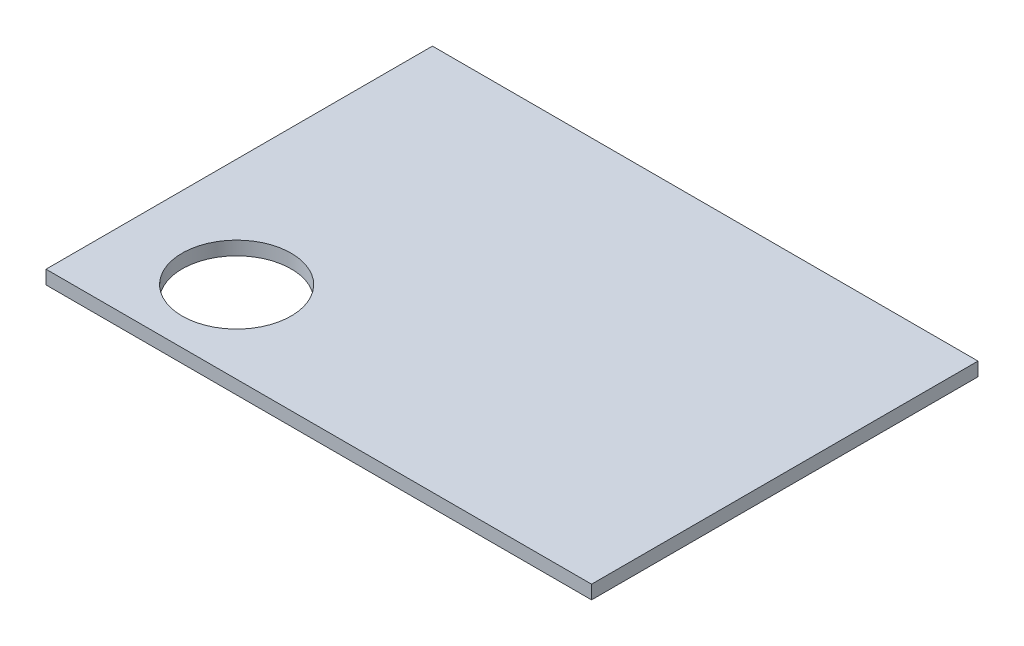
ISO-10303-21;
HEADER;
FILE_DESCRIPTION(('STEP AP214'),'2;1');
FILE_NAME('part.step','',(''),(''),'','','');
FILE_SCHEMA(('AUTOMOTIVE_DESIGN { 1 0 10303 214 1 1 1 1 }'));
ENDSEC;
DATA;
#1=APPLICATION_CONTEXT('core data for automotive mechanical design processes');
#2=APPLICATION_PROTOCOL_DEFINITION('international standard','automotive_design',2000,#1);
#3=PRODUCT_CONTEXT('',#1,'mechanical');
#4=PRODUCT('Part','Part','',(#3));
#5=PRODUCT_RELATED_PRODUCT_CATEGORY('part','',(#4));
#6=PRODUCT_DEFINITION_FORMATION('','',#4);
#7=PRODUCT_DEFINITION_CONTEXT('part definition',#1,'design');
#8=PRODUCT_DEFINITION('design','',#6,#7);
#9=PRODUCT_DEFINITION_SHAPE('','',#8);
#10=(LENGTH_UNIT() NAMED_UNIT(*) SI_UNIT(.MILLI.,.METRE.));
#11=(NAMED_UNIT(*) PLANE_ANGLE_UNIT() SI_UNIT($,.RADIAN.));
#12=(NAMED_UNIT(*) SI_UNIT($,.STERADIAN.) SOLID_ANGLE_UNIT());
#13=UNCERTAINTY_MEASURE_WITH_UNIT(LENGTH_MEASURE(1.E-05),#10,'distance_accuracy_value','');
#14=(GEOMETRIC_REPRESENTATION_CONTEXT(3) GLOBAL_UNCERTAINTY_ASSIGNED_CONTEXT((#13)) GLOBAL_UNIT_ASSIGNED_CONTEXT((#10,
#11,#12)) REPRESENTATION_CONTEXT('',''));
#15=CARTESIAN_POINT('',(0.,0.,0.));
#16=DIRECTION('',(0.,0.,1.));
#17=DIRECTION('',(1.,0.,0.));
#18=AXIS2_PLACEMENT_3D('',#15,#16,#17);
#19=CARTESIAN_POINT('',(-60.,3.,42.5));
#20=DIRECTION('',(1.,0.,0.));
#21=DIRECTION('',(0.,0.,-1.));
#22=AXIS2_PLACEMENT_3D('',#19,#20,#21);
#23=PLANE('',#22);
#24=DIRECTION('',(0.,0.,1.));
#25=VECTOR('',#24,1.);
#26=CARTESIAN_POINT('',(-60.,0.,42.5));
#27=LINE('',#26,#25);
#28=CARTESIAN_POINT('',(-60.,0.,-42.5));
#29=VERTEX_POINT('',#28);
#30=CARTESIAN_POINT('',(-60.,0.,42.5));
#31=VERTEX_POINT('',#30);
#32=EDGE_CURVE('E106',#29,#31,#27,.T.);
#33=ORIENTED_EDGE('',*,*,#32,.T.);
#34=DIRECTION('',(0.,-1.,0.));
#35=VECTOR('',#34,1.);
#36=CARTESIAN_POINT('',(-60.,3.,42.5));
#37=LINE('',#36,#35);
#38=CARTESIAN_POINT('',(-60.,3.,42.5));
#39=VERTEX_POINT('',#38);
#40=EDGE_CURVE('E11',#39,#31,#37,.T.);
#41=ORIENTED_EDGE('',*,*,#40,.F.);
#42=DIRECTION('',(0.,0.,1.));
#43=VECTOR('',#42,1.);
#44=CARTESIAN_POINT('',(-60.,3.,42.5));
#45=LINE('',#44,#43);
#46=CARTESIAN_POINT('',(-60.,3.,-42.5));
#47=VERTEX_POINT('',#46);
#48=EDGE_CURVE('E90',#47,#39,#45,.T.);
#49=ORIENTED_EDGE('',*,*,#48,.F.);
#50=DIRECTION('',(0.,-1.,0.));
#51=VECTOR('',#50,1.);
#52=CARTESIAN_POINT('',(-60.,3.,-42.5));
#53=LINE('',#52,#51);
#54=EDGE_CURVE('E102',#47,#29,#53,.T.);
#55=ORIENTED_EDGE('',*,*,#54,.T.);
#56=EDGE_LOOP('',(#33,#41,#49,#55));
#57=FACE_BOUND('',#56,.T.);
#58=ADVANCED_FACE('F38',(#57),#23,.F.);
#59=CARTESIAN_POINT('',(60.,3.,42.5));
#60=DIRECTION('',(0.,0.,-1.));
#61=DIRECTION('',(-1.,0.,0.));
#62=AXIS2_PLACEMENT_3D('',#59,#60,#61);
#63=PLANE('',#62);
#64=DIRECTION('',(1.,0.,0.));
#65=VECTOR('',#64,1.);
#66=CARTESIAN_POINT('',(60.,0.,42.5));
#67=LINE('',#66,#65);
#68=CARTESIAN_POINT('',(60.,0.,42.5));
#69=VERTEX_POINT('',#68);
#70=EDGE_CURVE('E95',#31,#69,#67,.T.);
#71=ORIENTED_EDGE('',*,*,#70,.T.);
#72=DIRECTION('',(0.,-1.,0.));
#73=VECTOR('',#72,1.);
#74=CARTESIAN_POINT('',(60.,3.,42.5));
#75=LINE('',#74,#73);
#76=CARTESIAN_POINT('',(60.,3.,42.5));
#77=VERTEX_POINT('',#76);
#78=EDGE_CURVE('E47',#77,#69,#75,.T.);
#79=ORIENTED_EDGE('',*,*,#78,.F.);
#80=DIRECTION('',(1.,0.,0.));
#81=VECTOR('',#80,1.);
#82=CARTESIAN_POINT('',(60.,3.,42.5));
#83=LINE('',#82,#81);
#84=EDGE_CURVE('E85',#39,#77,#83,.T.);
#85=ORIENTED_EDGE('',*,*,#84,.F.);
#86=ORIENTED_EDGE('',*,*,#40,.T.);
#87=EDGE_LOOP('',(#71,#79,#85,#86));
#88=FACE_BOUND('',#87,.T.);
#89=ADVANCED_FACE('F94',(#88),#63,.F.);
#90=CARTESIAN_POINT('',(60.,3.,42.5));
#91=DIRECTION('',(-1.,0.,0.));
#92=DIRECTION('',(0.,0.,1.));
#93=AXIS2_PLACEMENT_3D('',#90,#91,#92);
#94=PLANE('',#93);
#95=DIRECTION('',(0.,0.,-1.));
#96=VECTOR('',#95,1.);
#97=CARTESIAN_POINT('',(60.,0.,42.5));
#98=LINE('',#97,#96);
#99=CARTESIAN_POINT('',(60.,0.,-42.5));
#100=VERTEX_POINT('',#99);
#101=EDGE_CURVE('E72',#69,#100,#98,.T.);
#102=ORIENTED_EDGE('',*,*,#101,.T.);
#103=DIRECTION('',(0.,-1.,0.));
#104=VECTOR('',#103,1.);
#105=CARTESIAN_POINT('',(60.,3.,-42.5));
#106=LINE('',#105,#104);
#107=CARTESIAN_POINT('',(60.,3.,-42.5));
#108=VERTEX_POINT('',#107);
#109=EDGE_CURVE('E97',#108,#100,#106,.T.);
#110=ORIENTED_EDGE('',*,*,#109,.F.);
#111=DIRECTION('',(0.,0.,-1.));
#112=VECTOR('',#111,1.);
#113=CARTESIAN_POINT('',(60.,3.,42.5));
#114=LINE('',#113,#112);
#115=EDGE_CURVE('E88',#77,#108,#114,.T.);
#116=ORIENTED_EDGE('',*,*,#115,.F.);
#117=ORIENTED_EDGE('',*,*,#78,.T.);
#118=EDGE_LOOP('',(#102,#110,#116,#117));
#119=FACE_BOUND('',#118,.T.);
#120=ADVANCED_FACE('F98',(#119),#94,.F.);
#121=CARTESIAN_POINT('',(60.,3.,-42.5));
#122=DIRECTION('',(0.,0.,1.));
#123=DIRECTION('',(1.,0.,0.));
#124=AXIS2_PLACEMENT_3D('',#121,#122,#123);
#125=PLANE('',#124);
#126=DIRECTION('',(-1.,0.,0.));
#127=VECTOR('',#126,1.);
#128=CARTESIAN_POINT('',(60.,0.,-42.5));
#129=LINE('',#128,#127);
#130=EDGE_CURVE('E78',#100,#29,#129,.T.);
#131=ORIENTED_EDGE('',*,*,#130,.T.);
#132=ORIENTED_EDGE('',*,*,#54,.F.);
#133=DIRECTION('',(-1.,0.,0.));
#134=VECTOR('',#133,1.);
#135=CARTESIAN_POINT('',(60.,3.,-42.5));
#136=LINE('',#135,#134);
#137=EDGE_CURVE('E55',#108,#47,#136,.T.);
#138=ORIENTED_EDGE('',*,*,#137,.F.);
#139=ORIENTED_EDGE('',*,*,#109,.T.);
#140=EDGE_LOOP('',(#131,#132,#138,#139));
#141=FACE_BOUND('',#140,.T.);
#142=ADVANCED_FACE('F120',(#141),#125,.F.);
#143=CARTESIAN_POINT('',(0.,3.,0.));
#144=DIRECTION('',(0.,1.,0.));
#145=DIRECTION('',(0.,0.,1.));
#146=AXIS2_PLACEMENT_3D('',#143,#144,#145);
#147=PLANE('',#146);
#148=CARTESIAN_POINT('',(-36.1,3.,24.47));
#149=DIRECTION('',(0.,1.,0.));
#150=DIRECTION('',(0.,0.,1.));
#151=AXIS2_PLACEMENT_3D('',#148,#149,#150);
#152=CIRCLE('',#151,11.99);
#153=CARTESIAN_POINT('',(-36.1,3.,36.46));
#154=VERTEX_POINT('',#153);
#155=EDGE_CURVE('E127',#154,#154,#152,.T.);
#156=ORIENTED_EDGE('',*,*,#155,.F.);
#157=EDGE_LOOP('',(#156));
#158=FACE_BOUND('',#157,.T.);
#159=ORIENTED_EDGE('',*,*,#48,.T.);
#160=ORIENTED_EDGE('',*,*,#84,.T.);
#161=ORIENTED_EDGE('',*,*,#115,.T.);
#162=ORIENTED_EDGE('',*,*,#137,.T.);
#163=EDGE_LOOP('',(#159,#160,#161,#162));
#164=FACE_BOUND('',#163,.T.);
#165=ADVANCED_FACE('F86',(#158,#164),#147,.T.);
#166=CARTESIAN_POINT('',(0.,0.,0.));
#167=DIRECTION('',(0.,1.,0.));
#168=DIRECTION('',(0.,0.,1.));
#169=AXIS2_PLACEMENT_3D('',#166,#167,#168);
#170=PLANE('',#169);
#171=CARTESIAN_POINT('',(-36.1,0.,24.47));
#172=DIRECTION('',(0.,1.,0.));
#173=DIRECTION('',(0.,0.,1.));
#174=AXIS2_PLACEMENT_3D('',#171,#172,#173);
#175=CIRCLE('',#174,11.99);
#176=CARTESIAN_POINT('',(-36.1,0.,36.46));
#177=VERTEX_POINT('',#176);
#178=EDGE_CURVE('E110',#177,#177,#175,.T.);
#179=ORIENTED_EDGE('',*,*,#178,.T.);
#180=EDGE_LOOP('',(#179));
#181=FACE_BOUND('',#180,.T.);
#182=ORIENTED_EDGE('',*,*,#32,.F.);
#183=ORIENTED_EDGE('',*,*,#130,.F.);
#184=ORIENTED_EDGE('',*,*,#101,.F.);
#185=ORIENTED_EDGE('',*,*,#70,.F.);
#186=EDGE_LOOP('',(#182,#183,#184,#185));
#187=FACE_BOUND('',#186,.T.);
#188=ADVANCED_FACE('F123',(#181,#187),#170,.F.);
#189=CARTESIAN_POINT('',(-36.1,0.,24.47));
#190=DIRECTION('',(0.,1.,0.));
#191=DIRECTION('',(0.,0.,1.));
#192=AXIS2_PLACEMENT_3D('',#189,#190,#191);
#193=CYLINDRICAL_SURFACE('',#192,11.99);
#194=ORIENTED_EDGE('',*,*,#178,.F.);
#195=EDGE_LOOP('',(#194));
#196=FACE_BOUND('',#195,.T.);
#197=ORIENTED_EDGE('',*,*,#155,.T.);
#198=EDGE_LOOP('',(#197));
#199=FACE_BOUND('',#198,.T.);
#200=ADVANCED_FACE('F136',(#196,#199),#193,.F.);
#201=CLOSED_SHELL('',(#58,#89,#120,#142,#165,#188,#200));
#202=MANIFOLD_SOLID_BREP('B2',#201);
#203=ADVANCED_BREP_SHAPE_REPRESENTATION('',(#18,#202),#14);
#204=SHAPE_DEFINITION_REPRESENTATION(#9,#203);
ENDSEC;
END-ISO-10303-21;
